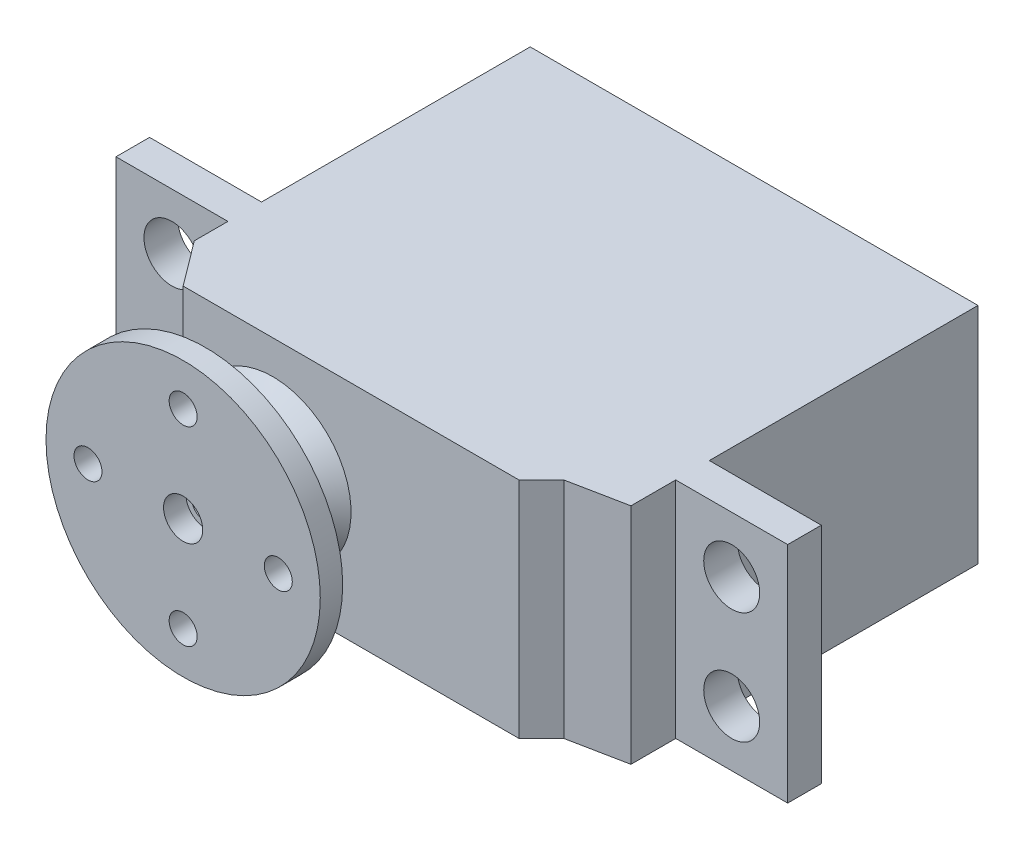
ISO-10303-21;
HEADER;
FILE_DESCRIPTION(('STEP AP214'),'2;1');
FILE_NAME('part.step','',(''),(''),'','','');
FILE_SCHEMA(('AUTOMOTIVE_DESIGN { 1 0 10303 214 1 1 1 1 }'));
ENDSEC;
DATA;
#1=APPLICATION_CONTEXT('core data for automotive mechanical design processes');
#2=APPLICATION_PROTOCOL_DEFINITION('international standard','automotive_design',2000,#1);
#3=PRODUCT_CONTEXT('',#1,'mechanical');
#4=PRODUCT('Part','Part','',(#3));
#5=PRODUCT_RELATED_PRODUCT_CATEGORY('part','',(#4));
#6=PRODUCT_DEFINITION_FORMATION('','',#4);
#7=PRODUCT_DEFINITION_CONTEXT('part definition',#1,'design');
#8=PRODUCT_DEFINITION('design','',#6,#7);
#9=PRODUCT_DEFINITION_SHAPE('','',#8);
#10=(LENGTH_UNIT() NAMED_UNIT(*) SI_UNIT(.MILLI.,.METRE.));
#11=(NAMED_UNIT(*) PLANE_ANGLE_UNIT() SI_UNIT($,.RADIAN.));
#12=(NAMED_UNIT(*) SI_UNIT($,.STERADIAN.) SOLID_ANGLE_UNIT());
#13=UNCERTAINTY_MEASURE_WITH_UNIT(LENGTH_MEASURE(1.E-05),#10,'distance_accuracy_value','');
#14=(GEOMETRIC_REPRESENTATION_CONTEXT(3) GLOBAL_UNCERTAINTY_ASSIGNED_CONTEXT((#13)) GLOBAL_UNIT_ASSIGNED_CONTEXT((#10,
#11,#12)) REPRESENTATION_CONTEXT('',''));
#15=CARTESIAN_POINT('',(0.,0.,0.));
#16=DIRECTION('',(0.,0.,1.));
#17=DIRECTION('',(1.,0.,0.));
#18=AXIS2_PLACEMENT_3D('',#15,#16,#17);
#19=CARTESIAN_POINT('',(20.,-10.,37.));
#20=DIRECTION('',(-1.,0.,0.));
#21=DIRECTION('',(0.,0.,1.));
#22=AXIS2_PLACEMENT_3D('',#19,#20,#21);
#23=PLANE('',#22);
#24=DIRECTION('',(0.,1.,0.));
#25=VECTOR('',#24,1.);
#26=CARTESIAN_POINT('',(20.,10.,27.));
#27=LINE('',#26,#25);
#28=CARTESIAN_POINT('',(20.,-10.,27.));
#29=VERTEX_POINT('',#28);
#30=CARTESIAN_POINT('',(20.,10.,27.));
#31=VERTEX_POINT('',#30);
#32=EDGE_CURVE('E59',#29,#31,#27,.T.);
#33=ORIENTED_EDGE('',*,*,#32,.F.);
#34=DIRECTION('',(0.,0.,-1.));
#35=VECTOR('',#34,1.);
#36=CARTESIAN_POINT('',(20.,-10.,37.));
#37=LINE('',#36,#35);
#38=CARTESIAN_POINT('',(20.,-10.,3.));
#39=VERTEX_POINT('',#38);
#40=EDGE_CURVE('E290',#29,#39,#37,.T.);
#41=ORIENTED_EDGE('',*,*,#40,.T.);
#42=DIRECTION('',(0.,1.,0.));
#43=VECTOR('',#42,1.);
#44=CARTESIAN_POINT('',(20.,10.,3.));
#45=LINE('',#44,#43);
#46=CARTESIAN_POINT('',(20.,10.,3.));
#47=VERTEX_POINT('',#46);
#48=EDGE_CURVE('E303',#39,#47,#45,.T.);
#49=ORIENTED_EDGE('',*,*,#48,.T.);
#50=DIRECTION('',(0.,0.,-1.));
#51=VECTOR('',#50,1.);
#52=CARTESIAN_POINT('',(20.,10.,37.));
#53=LINE('',#52,#51);
#54=EDGE_CURVE('E300',#31,#47,#53,.T.);
#55=ORIENTED_EDGE('',*,*,#54,.F.);
#56=EDGE_LOOP('',(#33,#41,#49,#55));
#57=FACE_BOUND('',#56,.T.);
#58=ADVANCED_FACE('F36',(#57),#23,.F.);
#59=CARTESIAN_POINT('',(-20.,-10.,37.));
#60=DIRECTION('',(1.,0.,0.));
#61=DIRECTION('',(0.,0.,-1.));
#62=AXIS2_PLACEMENT_3D('',#59,#60,#61);
#63=PLANE('',#62);
#64=DIRECTION('',(0.,-1.,0.));
#65=VECTOR('',#64,1.);
#66=CARTESIAN_POINT('',(-20.,10.,27.));
#67=LINE('',#66,#65);
#68=CARTESIAN_POINT('',(-20.,10.,27.));
#69=VERTEX_POINT('',#68);
#70=CARTESIAN_POINT('',(-20.,-10.,27.));
#71=VERTEX_POINT('',#70);
#72=EDGE_CURVE('E226',#69,#71,#67,.T.);
#73=ORIENTED_EDGE('',*,*,#72,.F.);
#74=DIRECTION('',(0.,0.,-1.));
#75=VECTOR('',#74,1.);
#76=CARTESIAN_POINT('',(-20.,10.,37.));
#77=LINE('',#76,#75);
#78=CARTESIAN_POINT('',(-20.,10.,3.));
#79=VERTEX_POINT('',#78);
#80=EDGE_CURVE('E297',#69,#79,#77,.T.);
#81=ORIENTED_EDGE('',*,*,#80,.T.);
#82=DIRECTION('',(0.,-1.,0.));
#83=VECTOR('',#82,1.);
#84=CARTESIAN_POINT('',(-20.,-10.,3.));
#85=LINE('',#84,#83);
#86=CARTESIAN_POINT('',(-20.,-10.,3.));
#87=VERTEX_POINT('',#86);
#88=EDGE_CURVE('E319',#79,#87,#85,.T.);
#89=ORIENTED_EDGE('',*,*,#88,.T.);
#90=DIRECTION('',(0.,0.,-1.));
#91=VECTOR('',#90,1.);
#92=CARTESIAN_POINT('',(-20.,-10.,37.));
#93=LINE('',#92,#91);
#94=EDGE_CURVE('E293',#71,#87,#93,.T.);
#95=ORIENTED_EDGE('',*,*,#94,.F.);
#96=EDGE_LOOP('',(#73,#81,#89,#95));
#97=FACE_BOUND('',#96,.T.);
#98=ADVANCED_FACE('F381',(#97),#63,.F.);
#99=CARTESIAN_POINT('',(20.,-10.,34.));
#100=VERTEX_POINT('',#99);
#101=CARTESIAN_POINT('',(20.,-10.,30.));
#102=VERTEX_POINT('',#101);
#103=EDGE_CURVE('E291',#100,#102,#37,.T.);
#104=ORIENTED_EDGE('',*,*,#103,.T.);
#105=DIRECTION('',(0.,1.,0.));
#106=VECTOR('',#105,1.);
#107=CARTESIAN_POINT('',(20.,10.,30.));
#108=LINE('',#107,#106);
#109=CARTESIAN_POINT('',(20.,10.,30.));
#110=VERTEX_POINT('',#109);
#111=EDGE_CURVE('E51',#102,#110,#108,.T.);
#112=ORIENTED_EDGE('',*,*,#111,.T.);
#113=CARTESIAN_POINT('',(20.,10.,34.));
#114=VERTEX_POINT('',#113);
#115=EDGE_CURVE('E301',#114,#110,#53,.T.);
#116=ORIENTED_EDGE('',*,*,#115,.F.);
#117=DIRECTION('',(0.,-1.,0.));
#118=VECTOR('',#117,1.);
#119=CARTESIAN_POINT('',(20.,10.,34.));
#120=LINE('',#119,#118);
#121=EDGE_CURVE('E278',#114,#100,#120,.T.);
#122=ORIENTED_EDGE('',*,*,#121,.T.);
#123=EDGE_LOOP('',(#104,#112,#116,#122));
#124=FACE_BOUND('',#123,.T.);
#125=ADVANCED_FACE('F409',(#124),#23,.F.);
#126=CARTESIAN_POINT('',(-20.,10.,37.));
#127=DIRECTION('',(0.,-1.,0.));
#128=DIRECTION('',(0.,0.,-1.));
#129=AXIS2_PLACEMENT_3D('',#126,#127,#128);
#130=PLANE('',#129);
#131=ORIENTED_EDGE('',*,*,#115,.T.);
#132=DIRECTION('',(1.,0.,0.));
#133=VECTOR('',#132,1.);
#134=CARTESIAN_POINT('',(20.,10.,30.));
#135=LINE('',#134,#133);
#136=CARTESIAN_POINT('',(30.,10.,30.));
#137=VERTEX_POINT('',#136);
#138=EDGE_CURVE('E196',#110,#137,#135,.T.);
#139=ORIENTED_EDGE('',*,*,#138,.T.);
#140=DIRECTION('',(0.,0.,1.));
#141=VECTOR('',#140,1.);
#142=CARTESIAN_POINT('',(30.,10.,27.));
#143=LINE('',#142,#141);
#144=CARTESIAN_POINT('',(30.,10.,27.));
#145=VERTEX_POINT('',#144);
#146=EDGE_CURVE('E219',#145,#137,#143,.T.);
#147=ORIENTED_EDGE('',*,*,#146,.F.);
#148=DIRECTION('',(1.,0.,0.));
#149=VECTOR('',#148,1.);
#150=CARTESIAN_POINT('',(20.,10.,27.));
#151=LINE('',#150,#149);
#152=EDGE_CURVE('E199',#31,#145,#151,.T.);
#153=ORIENTED_EDGE('',*,*,#152,.F.);
#154=ORIENTED_EDGE('',*,*,#54,.T.);
#155=DIRECTION('',(-1.,0.,0.));
#156=VECTOR('',#155,1.);
#157=CARTESIAN_POINT('',(-20.,10.,3.));
#158=LINE('',#157,#156);
#159=EDGE_CURVE('E316',#47,#79,#158,.T.);
#160=ORIENTED_EDGE('',*,*,#159,.T.);
#161=ORIENTED_EDGE('',*,*,#80,.F.);
#162=DIRECTION('',(1.,0.,0.));
#163=VECTOR('',#162,1.);
#164=CARTESIAN_POINT('',(-20.,10.,27.));
#165=LINE('',#164,#163);
#166=CARTESIAN_POINT('',(-30.,10.,27.));
#167=VERTEX_POINT('',#166);
#168=EDGE_CURVE('E223',#167,#69,#165,.T.);
#169=ORIENTED_EDGE('',*,*,#168,.F.);
#170=DIRECTION('',(0.,0.,1.));
#171=VECTOR('',#170,1.);
#172=CARTESIAN_POINT('',(-30.,10.,27.));
#173=LINE('',#172,#171);
#174=CARTESIAN_POINT('',(-30.,10.,30.));
#175=VERTEX_POINT('',#174);
#176=EDGE_CURVE('E234',#167,#175,#173,.T.);
#177=ORIENTED_EDGE('',*,*,#176,.T.);
#178=DIRECTION('',(1.,0.,0.));
#179=VECTOR('',#178,1.);
#180=CARTESIAN_POINT('',(-20.,10.,30.));
#181=LINE('',#180,#179);
#182=CARTESIAN_POINT('',(-20.,10.,30.));
#183=VERTEX_POINT('',#182);
#184=EDGE_CURVE('E222',#175,#183,#181,.T.);
#185=ORIENTED_EDGE('',*,*,#184,.T.);
#186=CARTESIAN_POINT('',(-20.,10.,33.));
#187=VERTEX_POINT('',#186);
#188=EDGE_CURVE('E298',#187,#183,#77,.T.);
#189=ORIENTED_EDGE('',*,*,#188,.F.);
#190=DIRECTION('',(0.6,0.,0.8));
#191=VECTOR('',#190,1.);
#192=CARTESIAN_POINT('',(-17.,10.,37.));
#193=LINE('',#192,#191);
#194=CARTESIAN_POINT('',(-17.,10.,37.));
#195=VERTEX_POINT('',#194);
#196=EDGE_CURVE('E255',#187,#195,#193,.T.);
#197=ORIENTED_EDGE('',*,*,#196,.T.);
#198=DIRECTION('',(-1.,0.,0.));
#199=VECTOR('',#198,1.);
#200=CARTESIAN_POINT('',(-20.,10.,37.));
#201=LINE('',#200,#199);
#202=CARTESIAN_POINT('',(13.,10.,37.));
#203=VERTEX_POINT('',#202);
#204=EDGE_CURVE('E281',#203,#195,#201,.T.);
#205=ORIENTED_EDGE('',*,*,#204,.F.);
#206=DIRECTION('',(0.707106781186547,0.,-0.707106781186548));
#207=VECTOR('',#206,1.);
#208=CARTESIAN_POINT('',(15.,10.,35.));
#209=LINE('',#208,#207);
#210=CARTESIAN_POINT('',(15.,10.,35.));
#211=VERTEX_POINT('',#210);
#212=EDGE_CURVE('E267',#203,#211,#209,.T.);
#213=ORIENTED_EDGE('',*,*,#212,.T.);
#214=DIRECTION('',(0.98058067569092,0.,-0.196116135138184));
#215=VECTOR('',#214,1.);
#216=CARTESIAN_POINT('',(20.,10.,34.));
#217=LINE('',#216,#215);
#218=EDGE_CURVE('E270',#211,#114,#217,.T.);
#219=ORIENTED_EDGE('',*,*,#218,.T.);
#220=EDGE_LOOP('',(#131,#139,#147,#153,#154,#160,#161,#169,#177,#185,#189,#197,#205,#213,#219));
#221=FACE_BOUND('',#220,.T.);
#222=ADVANCED_FACE('F350',(#221),#130,.F.);
#223=ORIENTED_EDGE('',*,*,#188,.T.);
#224=DIRECTION('',(0.,-1.,0.));
#225=VECTOR('',#224,1.);
#226=CARTESIAN_POINT('',(-20.,10.,30.));
#227=LINE('',#226,#225);
#228=CARTESIAN_POINT('',(-20.,-10.,30.));
#229=VERTEX_POINT('',#228);
#230=EDGE_CURVE('E238',#183,#229,#227,.T.);
#231=ORIENTED_EDGE('',*,*,#230,.T.);
#232=CARTESIAN_POINT('',(-20.,-10.,33.));
#233=VERTEX_POINT('',#232);
#234=EDGE_CURVE('E294',#233,#229,#93,.T.);
#235=ORIENTED_EDGE('',*,*,#234,.F.);
#236=DIRECTION('',(0.,-1.,0.));
#237=VECTOR('',#236,1.);
#238=CARTESIAN_POINT('',(-20.,10.,33.));
#239=LINE('',#238,#237);
#240=EDGE_CURVE('E258',#187,#233,#239,.T.);
#241=ORIENTED_EDGE('',*,*,#240,.F.);
#242=EDGE_LOOP('',(#223,#231,#235,#241));
#243=FACE_BOUND('',#242,.T.);
#244=ADVANCED_FACE('F358',(#243),#63,.F.);
#245=CARTESIAN_POINT('',(-20.,-10.,37.));
#246=DIRECTION('',(0.,1.,0.));
#247=DIRECTION('',(0.,0.,1.));
#248=AXIS2_PLACEMENT_3D('',#245,#246,#247);
#249=PLANE('',#248);
#250=ORIENTED_EDGE('',*,*,#234,.T.);
#251=DIRECTION('',(-1.,0.,0.));
#252=VECTOR('',#251,1.);
#253=CARTESIAN_POINT('',(-20.,-10.,30.));
#254=LINE('',#253,#252);
#255=CARTESIAN_POINT('',(-30.,-10.,30.));
#256=VERTEX_POINT('',#255);
#257=EDGE_CURVE('E240',#229,#256,#254,.T.);
#258=ORIENTED_EDGE('',*,*,#257,.T.);
#259=DIRECTION('',(0.,0.,1.));
#260=VECTOR('',#259,1.);
#261=CARTESIAN_POINT('',(-30.,-10.,27.));
#262=LINE('',#261,#260);
#263=CARTESIAN_POINT('',(-30.,-10.,27.));
#264=VERTEX_POINT('',#263);
#265=EDGE_CURVE('E245',#264,#256,#262,.T.);
#266=ORIENTED_EDGE('',*,*,#265,.F.);
#267=DIRECTION('',(-1.,0.,0.));
#268=VECTOR('',#267,1.);
#269=CARTESIAN_POINT('',(-20.,-10.,27.));
#270=LINE('',#269,#268);
#271=EDGE_CURVE('E230',#71,#264,#270,.T.);
#272=ORIENTED_EDGE('',*,*,#271,.F.);
#273=ORIENTED_EDGE('',*,*,#94,.T.);
#274=DIRECTION('',(1.,0.,0.));
#275=VECTOR('',#274,1.);
#276=CARTESIAN_POINT('',(20.,-10.,3.));
#277=LINE('',#276,#275);
#278=EDGE_CURVE('E322',#87,#39,#277,.T.);
#279=ORIENTED_EDGE('',*,*,#278,.T.);
#280=ORIENTED_EDGE('',*,*,#40,.F.);
#281=DIRECTION('',(-1.,0.,0.));
#282=VECTOR('',#281,1.);
#283=CARTESIAN_POINT('',(20.,-10.,27.));
#284=LINE('',#283,#282);
#285=CARTESIAN_POINT('',(30.,-10.,27.));
#286=VERTEX_POINT('',#285);
#287=EDGE_CURVE('E204',#286,#29,#284,.T.);
#288=ORIENTED_EDGE('',*,*,#287,.F.);
#289=DIRECTION('',(0.,0.,1.));
#290=VECTOR('',#289,1.);
#291=CARTESIAN_POINT('',(30.,-10.,27.));
#292=LINE('',#291,#290);
#293=CARTESIAN_POINT('',(30.,-10.,30.));
#294=VERTEX_POINT('',#293);
#295=EDGE_CURVE('E208',#286,#294,#292,.T.);
#296=ORIENTED_EDGE('',*,*,#295,.T.);
#297=DIRECTION('',(-1.,0.,0.));
#298=VECTOR('',#297,1.);
#299=CARTESIAN_POINT('',(20.,-10.,30.));
#300=LINE('',#299,#298);
#301=EDGE_CURVE('E213',#294,#102,#300,.T.);
#302=ORIENTED_EDGE('',*,*,#301,.T.);
#303=ORIENTED_EDGE('',*,*,#103,.F.);
#304=DIRECTION('',(0.98058067569092,0.,-0.196116135138184));
#305=VECTOR('',#304,1.);
#306=CARTESIAN_POINT('',(20.,-10.,34.));
#307=LINE('',#306,#305);
#308=CARTESIAN_POINT('',(15.,-10.,35.));
#309=VERTEX_POINT('',#308);
#310=EDGE_CURVE('E271',#309,#100,#307,.T.);
#311=ORIENTED_EDGE('',*,*,#310,.F.);
#312=DIRECTION('',(0.707106781186547,0.,-0.707106781186548));
#313=VECTOR('',#312,1.);
#314=CARTESIAN_POINT('',(15.,-10.,35.));
#315=LINE('',#314,#313);
#316=CARTESIAN_POINT('',(13.,-10.,37.));
#317=VERTEX_POINT('',#316);
#318=EDGE_CURVE('E265',#317,#309,#315,.T.);
#319=ORIENTED_EDGE('',*,*,#318,.F.);
#320=DIRECTION('',(1.,0.,0.));
#321=VECTOR('',#320,1.);
#322=CARTESIAN_POINT('',(-20.,-10.,37.));
#323=LINE('',#322,#321);
#324=CARTESIAN_POINT('',(-17.,-10.,37.));
#325=VERTEX_POINT('',#324);
#326=EDGE_CURVE('E288',#325,#317,#323,.T.);
#327=ORIENTED_EDGE('',*,*,#326,.F.);
#328=DIRECTION('',(0.6,0.,0.8));
#329=VECTOR('',#328,1.);
#330=CARTESIAN_POINT('',(-17.,-10.,37.));
#331=LINE('',#330,#329);
#332=EDGE_CURVE('E259',#233,#325,#331,.T.);
#333=ORIENTED_EDGE('',*,*,#332,.F.);
#334=EDGE_LOOP('',(#250,#258,#266,#272,#273,#279,#280,#288,#296,#302,#303,#311,#319,#327,#333));
#335=FACE_BOUND('',#334,.T.);
#336=ADVANCED_FACE('F344',(#335),#249,.F.);
#337=CARTESIAN_POINT('',(0.,0.,37.));
#338=DIRECTION('',(0.,0.,-1.));
#339=DIRECTION('',(-1.,0.,0.));
#340=AXIS2_PLACEMENT_3D('',#337,#338,#339);
#341=PLANE('',#340);
#342=CARTESIAN_POINT('',(-9.,0.,37.));
#343=DIRECTION('',(0.,0.,-1.));
#344=DIRECTION('',(-1.,0.,0.));
#345=AXIS2_PLACEMENT_3D('',#342,#343,#344);
#346=CIRCLE('',#345,7.);
#347=CARTESIAN_POINT('',(-16.,0.,37.));
#348=VERTEX_POINT('',#347);
#349=EDGE_CURVE('E44',#348,#348,#346,.F.);
#350=ORIENTED_EDGE('',*,*,#349,.F.);
#351=EDGE_LOOP('',(#350));
#352=FACE_BOUND('',#351,.T.);
#353=ORIENTED_EDGE('',*,*,#204,.T.);
#354=DIRECTION('',(0.,-1.,0.));
#355=VECTOR('',#354,1.);
#356=CARTESIAN_POINT('',(-17.,10.,37.));
#357=LINE('',#356,#355);
#358=EDGE_CURVE('E262',#195,#325,#357,.T.);
#359=ORIENTED_EDGE('',*,*,#358,.T.);
#360=ORIENTED_EDGE('',*,*,#326,.T.);
#361=DIRECTION('',(0.,-1.,0.));
#362=VECTOR('',#361,1.);
#363=CARTESIAN_POINT('',(13.,10.,37.));
#364=LINE('',#363,#362);
#365=EDGE_CURVE('E274',#203,#317,#364,.T.);
#366=ORIENTED_EDGE('',*,*,#365,.F.);
#367=EDGE_LOOP('',(#353,#359,#360,#366));
#368=FACE_BOUND('',#367,.T.);
#369=ADVANCED_FACE('F340',(#352,#368),#341,.F.);
#370=CARTESIAN_POINT('',(0.,0.,0.));
#371=DIRECTION('',(0.,0.,-1.));
#372=DIRECTION('',(-1.,0.,0.));
#373=AXIS2_PLACEMENT_3D('',#370,#371,#372);
#374=PLANE('',#373);
#375=DIRECTION('',(1.,0.,0.));
#376=VECTOR('',#375,1.);
#377=CARTESIAN_POINT('',(20.,6.99999999999999,0.));
#378=LINE('',#377,#376);
#379=CARTESIAN_POINT('',(-17.,6.99999999999999,0.));
#380=VERTEX_POINT('',#379);
#381=CARTESIAN_POINT('',(17.,6.99999999999999,0.));
#382=VERTEX_POINT('',#381);
#383=EDGE_CURVE('E310',#380,#382,#378,.T.);
#384=ORIENTED_EDGE('',*,*,#383,.T.);
#385=DIRECTION('',(0.,-1.,0.));
#386=VECTOR('',#385,1.);
#387=CARTESIAN_POINT('',(17.,-10.,0.));
#388=LINE('',#387,#386);
#389=CARTESIAN_POINT('',(17.,-6.99999999999999,0.));
#390=VERTEX_POINT('',#389);
#391=EDGE_CURVE('E313',#382,#390,#388,.T.);
#392=ORIENTED_EDGE('',*,*,#391,.T.);
#393=DIRECTION('',(-1.,0.,0.));
#394=VECTOR('',#393,1.);
#395=CARTESIAN_POINT('',(-20.,-6.99999999999999,0.));
#396=LINE('',#395,#394);
#397=CARTESIAN_POINT('',(-17.,-6.99999999999999,0.));
#398=VERTEX_POINT('',#397);
#399=EDGE_CURVE('E306',#390,#398,#396,.T.);
#400=ORIENTED_EDGE('',*,*,#399,.T.);
#401=DIRECTION('',(0.,1.,0.));
#402=VECTOR('',#401,1.);
#403=CARTESIAN_POINT('',(-17.,10.,0.));
#404=LINE('',#403,#402);
#405=EDGE_CURVE('E308',#398,#380,#404,.T.);
#406=ORIENTED_EDGE('',*,*,#405,.T.);
#407=EDGE_LOOP('',(#384,#392,#400,#406));
#408=FACE_BOUND('',#407,.T.);
#409=ADVANCED_FACE('F343',(#408),#374,.T.);
#410=CARTESIAN_POINT('',(20.,10.,34.));
#411=DIRECTION('',(-0.196116135138184,0.,-0.98058067569092));
#412=DIRECTION('',(-0.98058067569092,0.,0.196116135138184));
#413=AXIS2_PLACEMENT_3D('',#410,#411,#412);
#414=PLANE('',#413);
#415=ORIENTED_EDGE('',*,*,#310,.T.);
#416=ORIENTED_EDGE('',*,*,#121,.F.);
#417=ORIENTED_EDGE('',*,*,#218,.F.);
#418=DIRECTION('',(0.,-1.,0.));
#419=VECTOR('',#418,1.);
#420=CARTESIAN_POINT('',(15.,10.,35.));
#421=LINE('',#420,#419);
#422=EDGE_CURVE('E282',#211,#309,#421,.T.);
#423=ORIENTED_EDGE('',*,*,#422,.T.);
#424=EDGE_LOOP('',(#415,#416,#417,#423));
#425=FACE_BOUND('',#424,.T.);
#426=ADVANCED_FACE('F413',(#425),#414,.F.);
#427=CARTESIAN_POINT('',(15.,10.,35.));
#428=DIRECTION('',(-0.707106781186548,0.,-0.707106781186547));
#429=DIRECTION('',(-0.707106781186547,0.,0.707106781186548));
#430=AXIS2_PLACEMENT_3D('',#427,#428,#429);
#431=PLANE('',#430);
#432=ORIENTED_EDGE('',*,*,#318,.T.);
#433=ORIENTED_EDGE('',*,*,#422,.F.);
#434=ORIENTED_EDGE('',*,*,#212,.F.);
#435=ORIENTED_EDGE('',*,*,#365,.T.);
#436=EDGE_LOOP('',(#432,#433,#434,#435));
#437=FACE_BOUND('',#436,.T.);
#438=ADVANCED_FACE('F415',(#437),#431,.F.);
#439=CARTESIAN_POINT('',(-17.,10.,37.));
#440=DIRECTION('',(0.8,0.,-0.6));
#441=DIRECTION('',(-0.6,0.,-0.8));
#442=AXIS2_PLACEMENT_3D('',#439,#440,#441);
#443=PLANE('',#442);
#444=ORIENTED_EDGE('',*,*,#332,.T.);
#445=ORIENTED_EDGE('',*,*,#358,.F.);
#446=ORIENTED_EDGE('',*,*,#196,.F.);
#447=ORIENTED_EDGE('',*,*,#240,.T.);
#448=EDGE_LOOP('',(#444,#445,#446,#447));
#449=FACE_BOUND('',#448,.T.);
#450=ADVANCED_FACE('F354',(#449),#443,.F.);
#451=CARTESIAN_POINT('',(-20.,-10.,3.));
#452=DIRECTION('',(-0.707106781186547,0.,-0.707106781186548));
#453=DIRECTION('',(0.,1.,0.));
#454=AXIS2_PLACEMENT_3D('',#451,#452,#453);
#455=PLANE('',#454);
#456=DIRECTION('',(0.577350269189626,-0.577350269189626,-0.577350269189625));
#457=VECTOR('',#456,1.);
#458=CARTESIAN_POINT('',(-13.3333333333333,3.33333333333332,-3.66666666666666));
#459=LINE('',#458,#457);
#460=EDGE_CURVE('E331',#380,#79,#459,.F.);
#461=ORIENTED_EDGE('',*,*,#460,.F.);
#462=ORIENTED_EDGE('',*,*,#405,.F.);
#463=DIRECTION('',(0.577350269189626,0.577350269189626,-0.577350269189625));
#464=VECTOR('',#463,1.);
#465=CARTESIAN_POINT('',(-20.,-10.,3.));
#466=LINE('',#465,#464);
#467=EDGE_CURVE('E261',#87,#398,#466,.T.);
#468=ORIENTED_EDGE('',*,*,#467,.F.);
#469=ORIENTED_EDGE('',*,*,#88,.F.);
#470=EDGE_LOOP('',(#461,#462,#468,#469));
#471=FACE_BOUND('',#470,.T.);
#472=ADVANCED_FACE('F385',(#471),#455,.T.);
#473=CARTESIAN_POINT('',(-20.,-10.,3.));
#474=DIRECTION('',(0.,-0.707106781186547,-0.707106781186548));
#475=DIRECTION('',(-1.,0.,0.));
#476=AXIS2_PLACEMENT_3D('',#473,#474,#475);
#477=PLANE('',#476);
#478=ORIENTED_EDGE('',*,*,#467,.T.);
#479=ORIENTED_EDGE('',*,*,#399,.F.);
#480=DIRECTION('',(0.577350269189626,-0.577350269189626,0.577350269189625));
#481=VECTOR('',#480,1.);
#482=CARTESIAN_POINT('',(6.66666666666665,3.33333333333335,-10.3333333333333));
#483=LINE('',#482,#481);
#484=EDGE_CURVE('E328',#39,#390,#483,.F.);
#485=ORIENTED_EDGE('',*,*,#484,.F.);
#486=ORIENTED_EDGE('',*,*,#278,.F.);
#487=EDGE_LOOP('',(#478,#479,#485,#486));
#488=FACE_BOUND('',#487,.T.);
#489=ADVANCED_FACE('F388',(#488),#477,.T.);
#490=CARTESIAN_POINT('',(-20.,10.,3.));
#491=DIRECTION('',(0.,0.707106781186547,-0.707106781186548));
#492=DIRECTION('',(1.,0.,0.));
#493=AXIS2_PLACEMENT_3D('',#490,#491,#492);
#494=PLANE('',#493);
#495=ORIENTED_EDGE('',*,*,#460,.T.);
#496=ORIENTED_EDGE('',*,*,#159,.F.);
#497=DIRECTION('',(-0.577350269189626,-0.577350269189626,-0.577350269189625));
#498=VECTOR('',#497,1.);
#499=CARTESIAN_POINT('',(6.66666666666665,-3.33333333333335,-10.3333333333333));
#500=LINE('',#499,#498);
#501=EDGE_CURVE('E252',#382,#47,#500,.F.);
#502=ORIENTED_EDGE('',*,*,#501,.F.);
#503=ORIENTED_EDGE('',*,*,#383,.F.);
#504=EDGE_LOOP('',(#495,#496,#502,#503));
#505=FACE_BOUND('',#504,.T.);
#506=ADVANCED_FACE('F448',(#505),#494,.T.);
#507=CARTESIAN_POINT('',(20.,-10.,3.));
#508=DIRECTION('',(0.707106781186547,0.,-0.707106781186548));
#509=DIRECTION('',(0.,-1.,0.));
#510=AXIS2_PLACEMENT_3D('',#507,#508,#509);
#511=PLANE('',#510);
#512=ORIENTED_EDGE('',*,*,#484,.T.);
#513=ORIENTED_EDGE('',*,*,#391,.F.);
#514=ORIENTED_EDGE('',*,*,#501,.T.);
#515=ORIENTED_EDGE('',*,*,#48,.F.);
#516=EDGE_LOOP('',(#512,#513,#514,#515));
#517=FACE_BOUND('',#516,.T.);
#518=ADVANCED_FACE('F392',(#517),#511,.T.);
#519=CARTESIAN_POINT('',(-9.,0.,39.));
#520=DIRECTION('',(0.,0.,1.));
#521=DIRECTION('',(1.,0.,0.));
#522=AXIS2_PLACEMENT_3D('',#519,#520,#521);
#523=PLANE('',#522);
#524=CARTESIAN_POINT('',(-9.,0.,39.));
#525=DIRECTION('',(0.,0.,1.));
#526=DIRECTION('',(1.,0.,0.));
#527=AXIS2_PLACEMENT_3D('',#524,#525,#526);
#528=CIRCLE('',#527,3.);
#529=CARTESIAN_POINT('',(-6.,0.,39.));
#530=VERTEX_POINT('',#529);
#531=EDGE_CURVE('E248',#530,#530,#528,.T.);
#532=ORIENTED_EDGE('',*,*,#531,.F.);
#533=EDGE_LOOP('',(#532));
#534=FACE_BOUND('',#533,.T.);
#535=CARTESIAN_POINT('',(-9.,0.,39.));
#536=DIRECTION('',(0.,0.,1.));
#537=DIRECTION('',(1.,0.,0.));
#538=AXIS2_PLACEMENT_3D('',#535,#536,#537);
#539=CIRCLE('',#538,5.);
#540=CARTESIAN_POINT('',(-4.,0.,39.));
#541=VERTEX_POINT('',#540);
#542=EDGE_CURVE('E11',#541,#541,#539,.T.);
#543=ORIENTED_EDGE('',*,*,#542,.T.);
#544=EDGE_LOOP('',(#543));
#545=FACE_BOUND('',#544,.T.);
#546=ADVANCED_FACE('F455',(#534,#545),#523,.T.);
#547=CARTESIAN_POINT('',(-9.,0.,39.));
#548=DIRECTION('',(0.,0.,-1.));
#549=DIRECTION('',(-1.,0.,0.));
#550=AXIS2_PLACEMENT_3D('',#547,#548,#549);
#551=CONICAL_SURFACE('',#550,5.,0.785398163397447);
#552=ORIENTED_EDGE('',*,*,#349,.T.);
#553=EDGE_LOOP('',(#552));
#554=FACE_BOUND('',#553,.T.);
#555=ORIENTED_EDGE('',*,*,#542,.F.);
#556=EDGE_LOOP('',(#555));
#557=FACE_BOUND('',#556,.T.);
#558=ADVANCED_FACE('F38',(#554,#557),#551,.T.);
#559=CARTESIAN_POINT('',(-9.,0.,43.));
#560=DIRECTION('',(0.,0.,-1.));
#561=DIRECTION('',(-1.,0.,0.));
#562=AXIS2_PLACEMENT_3D('',#559,#560,#561);
#563=CYLINDRICAL_SURFACE('',#562,3.);
#564=CARTESIAN_POINT('',(-9.,0.,43.));
#565=DIRECTION('',(0.,0.,1.));
#566=DIRECTION('',(1.,0.,0.));
#567=AXIS2_PLACEMENT_3D('',#564,#565,#566);
#568=CIRCLE('',#567,3.);
#569=CARTESIAN_POINT('',(-6.,0.,43.));
#570=VERTEX_POINT('',#569);
#571=EDGE_CURVE('E249',#570,#570,#568,.T.);
#572=ORIENTED_EDGE('',*,*,#571,.F.);
#573=EDGE_LOOP('',(#572));
#574=FACE_BOUND('',#573,.T.);
#575=ORIENTED_EDGE('',*,*,#531,.T.);
#576=EDGE_LOOP('',(#575));
#577=FACE_BOUND('',#576,.T.);
#578=ADVANCED_FACE('F499',(#574,#577),#563,.T.);
#579=CARTESIAN_POINT('',(-30.,10.,27.));
#580=DIRECTION('',(1.,0.,0.));
#581=DIRECTION('',(0.,0.,-1.));
#582=AXIS2_PLACEMENT_3D('',#579,#580,#581);
#583=PLANE('',#582);
#584=DIRECTION('',(0.,1.,0.));
#585=VECTOR('',#584,1.);
#586=CARTESIAN_POINT('',(-30.,10.,30.));
#587=LINE('',#586,#585);
#588=EDGE_CURVE('E227',#256,#175,#587,.T.);
#589=ORIENTED_EDGE('',*,*,#588,.T.);
#590=ORIENTED_EDGE('',*,*,#176,.F.);
#591=DIRECTION('',(0.,1.,0.));
#592=VECTOR('',#591,1.);
#593=CARTESIAN_POINT('',(-30.,10.,27.));
#594=LINE('',#593,#592);
#595=EDGE_CURVE('E232',#264,#167,#594,.T.);
#596=ORIENTED_EDGE('',*,*,#595,.F.);
#597=ORIENTED_EDGE('',*,*,#265,.T.);
#598=EDGE_LOOP('',(#589,#590,#596,#597));
#599=FACE_BOUND('',#598,.T.);
#600=ADVANCED_FACE('F369',(#599),#583,.F.);
#601=CARTESIAN_POINT('',(0.,0.,27.));
#602=DIRECTION('',(0.,0.,1.));
#603=DIRECTION('',(1.,0.,0.));
#604=AXIS2_PLACEMENT_3D('',#601,#602,#603);
#605=PLANE('',#604);
#606=CARTESIAN_POINT('',(-25.,-5.,27.));
#607=DIRECTION('',(0.,0.,1.));
#608=DIRECTION('',(1.,0.,0.));
#609=AXIS2_PLACEMENT_3D('',#606,#607,#608);
#610=CIRCLE('',#609,2.5);
#611=CARTESIAN_POINT('',(-22.5,-5.,27.));
#612=VERTEX_POINT('',#611);
#613=EDGE_CURVE('E187',#612,#612,#610,.T.);
#614=ORIENTED_EDGE('',*,*,#613,.T.);
#615=EDGE_LOOP('',(#614));
#616=FACE_BOUND('',#615,.T.);
#617=CARTESIAN_POINT('',(-25.,5.,27.));
#618=DIRECTION('',(0.,0.,1.));
#619=DIRECTION('',(1.,0.,0.));
#620=AXIS2_PLACEMENT_3D('',#617,#618,#619);
#621=CIRCLE('',#620,2.5);
#622=CARTESIAN_POINT('',(-22.5,5.,27.));
#623=VERTEX_POINT('',#622);
#624=EDGE_CURVE('E193',#623,#623,#621,.T.);
#625=ORIENTED_EDGE('',*,*,#624,.T.);
#626=EDGE_LOOP('',(#625));
#627=FACE_BOUND('',#626,.T.);
#628=ORIENTED_EDGE('',*,*,#168,.T.);
#629=ORIENTED_EDGE('',*,*,#72,.T.);
#630=ORIENTED_EDGE('',*,*,#271,.T.);
#631=ORIENTED_EDGE('',*,*,#595,.T.);
#632=EDGE_LOOP('',(#628,#629,#630,#631));
#633=FACE_BOUND('',#632,.T.);
#634=ADVANCED_FACE('F374',(#616,#627,#633),#605,.F.);
#635=CARTESIAN_POINT('',(0.,0.,30.));
#636=DIRECTION('',(0.,0.,1.));
#637=DIRECTION('',(1.,0.,0.));
#638=AXIS2_PLACEMENT_3D('',#635,#636,#637);
#639=PLANE('',#638);
#640=CARTESIAN_POINT('',(-25.,-5.,30.));
#641=DIRECTION('',(0.,0.,1.));
#642=DIRECTION('',(1.,0.,0.));
#643=AXIS2_PLACEMENT_3D('',#640,#641,#642);
#644=CIRCLE('',#643,2.5);
#645=CARTESIAN_POINT('',(-22.5,-5.,30.));
#646=VERTEX_POINT('',#645);
#647=EDGE_CURVE('E184',#646,#646,#644,.T.);
#648=ORIENTED_EDGE('',*,*,#647,.F.);
#649=EDGE_LOOP('',(#648));
#650=FACE_BOUND('',#649,.T.);
#651=CARTESIAN_POINT('',(-25.,5.,30.));
#652=DIRECTION('',(0.,0.,1.));
#653=DIRECTION('',(1.,0.,0.));
#654=AXIS2_PLACEMENT_3D('',#651,#652,#653);
#655=CIRCLE('',#654,2.5);
#656=CARTESIAN_POINT('',(-22.5,5.,30.));
#657=VERTEX_POINT('',#656);
#658=EDGE_CURVE('E190',#657,#657,#655,.T.);
#659=ORIENTED_EDGE('',*,*,#658,.F.);
#660=EDGE_LOOP('',(#659));
#661=FACE_BOUND('',#660,.T.);
#662=ORIENTED_EDGE('',*,*,#184,.F.);
#663=ORIENTED_EDGE('',*,*,#588,.F.);
#664=ORIENTED_EDGE('',*,*,#257,.F.);
#665=ORIENTED_EDGE('',*,*,#230,.F.);
#666=EDGE_LOOP('',(#662,#663,#664,#665));
#667=FACE_BOUND('',#666,.T.);
#668=ADVANCED_FACE('F366',(#650,#661,#667),#639,.T.);
#669=CARTESIAN_POINT('',(30.,10.,27.));
#670=DIRECTION('',(-1.,0.,0.));
#671=DIRECTION('',(0.,0.,1.));
#672=AXIS2_PLACEMENT_3D('',#669,#670,#671);
#673=PLANE('',#672);
#674=DIRECTION('',(0.,-1.,0.));
#675=VECTOR('',#674,1.);
#676=CARTESIAN_POINT('',(30.,10.,30.));
#677=LINE('',#676,#675);
#678=EDGE_CURVE('E211',#137,#294,#677,.T.);
#679=ORIENTED_EDGE('',*,*,#678,.T.);
#680=ORIENTED_EDGE('',*,*,#295,.F.);
#681=DIRECTION('',(0.,-1.,0.));
#682=VECTOR('',#681,1.);
#683=CARTESIAN_POINT('',(30.,10.,27.));
#684=LINE('',#683,#682);
#685=EDGE_CURVE('E202',#145,#286,#684,.T.);
#686=ORIENTED_EDGE('',*,*,#685,.F.);
#687=ORIENTED_EDGE('',*,*,#146,.T.);
#688=EDGE_LOOP('',(#679,#680,#686,#687));
#689=FACE_BOUND('',#688,.T.);
#690=ADVANCED_FACE('F402',(#689),#673,.F.);
#691=CARTESIAN_POINT('',(0.,0.,27.));
#692=DIRECTION('',(0.,0.,-1.));
#693=DIRECTION('',(-1.,0.,0.));
#694=AXIS2_PLACEMENT_3D('',#691,#692,#693);
#695=PLANE('',#694);
#696=CARTESIAN_POINT('',(25.,-5.,27.));
#697=DIRECTION('',(0.,0.,-1.));
#698=DIRECTION('',(-1.,0.,0.));
#699=AXIS2_PLACEMENT_3D('',#696,#697,#698);
#700=CIRCLE('',#699,2.5);
#701=CARTESIAN_POINT('',(22.5,-5.,27.));
#702=VERTEX_POINT('',#701);
#703=EDGE_CURVE('E171',#702,#702,#700,.T.);
#704=ORIENTED_EDGE('',*,*,#703,.F.);
#705=EDGE_LOOP('',(#704));
#706=FACE_BOUND('',#705,.T.);
#707=CARTESIAN_POINT('',(25.,5.,27.));
#708=DIRECTION('',(0.,0.,-1.));
#709=DIRECTION('',(-1.,0.,0.));
#710=AXIS2_PLACEMENT_3D('',#707,#708,#709);
#711=CIRCLE('',#710,2.5);
#712=CARTESIAN_POINT('',(22.5,5.,27.));
#713=VERTEX_POINT('',#712);
#714=EDGE_CURVE('E181',#713,#713,#711,.T.);
#715=ORIENTED_EDGE('',*,*,#714,.F.);
#716=EDGE_LOOP('',(#715));
#717=FACE_BOUND('',#716,.T.);
#718=ORIENTED_EDGE('',*,*,#152,.T.);
#719=ORIENTED_EDGE('',*,*,#685,.T.);
#720=ORIENTED_EDGE('',*,*,#287,.T.);
#721=ORIENTED_EDGE('',*,*,#32,.T.);
#722=EDGE_LOOP('',(#718,#719,#720,#721));
#723=FACE_BOUND('',#722,.T.);
#724=ADVANCED_FACE('F397',(#706,#717,#723),#695,.T.);
#725=CARTESIAN_POINT('',(0.,0.,30.));
#726=DIRECTION('',(0.,0.,-1.));
#727=DIRECTION('',(-1.,0.,0.));
#728=AXIS2_PLACEMENT_3D('',#725,#726,#727);
#729=PLANE('',#728);
#730=CARTESIAN_POINT('',(25.,-5.,30.));
#731=DIRECTION('',(0.,0.,-1.));
#732=DIRECTION('',(-1.,0.,0.));
#733=AXIS2_PLACEMENT_3D('',#730,#731,#732);
#734=CIRCLE('',#733,2.5);
#735=CARTESIAN_POINT('',(22.5,-5.,30.));
#736=VERTEX_POINT('',#735);
#737=EDGE_CURVE('E167',#736,#736,#734,.T.);
#738=ORIENTED_EDGE('',*,*,#737,.T.);
#739=EDGE_LOOP('',(#738));
#740=FACE_BOUND('',#739,.T.);
#741=CARTESIAN_POINT('',(25.,5.,30.));
#742=DIRECTION('',(0.,0.,-1.));
#743=DIRECTION('',(-1.,0.,0.));
#744=AXIS2_PLACEMENT_3D('',#741,#742,#743);
#745=CIRCLE('',#744,2.5);
#746=CARTESIAN_POINT('',(22.5,5.,30.));
#747=VERTEX_POINT('',#746);
#748=EDGE_CURVE('E179',#747,#747,#745,.T.);
#749=ORIENTED_EDGE('',*,*,#748,.T.);
#750=EDGE_LOOP('',(#749));
#751=FACE_BOUND('',#750,.T.);
#752=ORIENTED_EDGE('',*,*,#138,.F.);
#753=ORIENTED_EDGE('',*,*,#111,.F.);
#754=ORIENTED_EDGE('',*,*,#301,.F.);
#755=ORIENTED_EDGE('',*,*,#678,.F.);
#756=EDGE_LOOP('',(#752,#753,#754,#755));
#757=FACE_BOUND('',#756,.T.);
#758=ADVANCED_FACE('F407',(#740,#751,#757),#729,.F.);
#759=CARTESIAN_POINT('',(-25.,5.,27.));
#760=DIRECTION('',(0.,0.,1.));
#761=DIRECTION('',(1.,0.,0.));
#762=AXIS2_PLACEMENT_3D('',#759,#760,#761);
#763=CYLINDRICAL_SURFACE('',#762,2.5);
#764=ORIENTED_EDGE('',*,*,#624,.F.);
#765=EDGE_LOOP('',(#764));
#766=FACE_BOUND('',#765,.T.);
#767=ORIENTED_EDGE('',*,*,#658,.T.);
#768=EDGE_LOOP('',(#767));
#769=FACE_BOUND('',#768,.T.);
#770=ADVANCED_FACE('F598',(#766,#769),#763,.F.);
#771=CARTESIAN_POINT('',(-25.,-5.,27.));
#772=DIRECTION('',(0.,0.,1.));
#773=DIRECTION('',(1.,0.,0.));
#774=AXIS2_PLACEMENT_3D('',#771,#772,#773);
#775=CYLINDRICAL_SURFACE('',#774,2.5);
#776=ORIENTED_EDGE('',*,*,#613,.F.);
#777=EDGE_LOOP('',(#776));
#778=FACE_BOUND('',#777,.T.);
#779=ORIENTED_EDGE('',*,*,#647,.T.);
#780=EDGE_LOOP('',(#779));
#781=FACE_BOUND('',#780,.T.);
#782=ADVANCED_FACE('F603',(#778,#781),#775,.F.);
#783=CARTESIAN_POINT('',(25.,5.,27.));
#784=DIRECTION('',(0.,0.,1.));
#785=DIRECTION('',(1.,0.,0.));
#786=AXIS2_PLACEMENT_3D('',#783,#784,#785);
#787=CYLINDRICAL_SURFACE('',#786,2.5);
#788=ORIENTED_EDGE('',*,*,#714,.T.);
#789=EDGE_LOOP('',(#788));
#790=FACE_BOUND('',#789,.T.);
#791=ORIENTED_EDGE('',*,*,#748,.F.);
#792=EDGE_LOOP('',(#791));
#793=FACE_BOUND('',#792,.T.);
#794=ADVANCED_FACE('F615',(#790,#793),#787,.F.);
#795=CARTESIAN_POINT('',(25.,-5.,27.));
#796=DIRECTION('',(0.,0.,1.));
#797=DIRECTION('',(1.,0.,0.));
#798=AXIS2_PLACEMENT_3D('',#795,#796,#797);
#799=CYLINDRICAL_SURFACE('',#798,2.5);
#800=ORIENTED_EDGE('',*,*,#703,.T.);
#801=EDGE_LOOP('',(#800));
#802=FACE_BOUND('',#801,.T.);
#803=ORIENTED_EDGE('',*,*,#737,.F.);
#804=EDGE_LOOP('',(#803));
#805=FACE_BOUND('',#804,.T.);
#806=ADVANCED_FACE('F642',(#802,#805),#799,.F.);
#807=CARTESIAN_POINT('',(-9.,0.,43.));
#808=DIRECTION('',(0.,0.,1.));
#809=DIRECTION('',(1.,0.,0.));
#810=AXIS2_PLACEMENT_3D('',#807,#808,#809);
#811=PLANE('',#810);
#812=CARTESIAN_POINT('',(-17.5,0.,43.));
#813=DIRECTION('',(0.,0.,1.));
#814=DIRECTION('',(1.,0.,0.));
#815=AXIS2_PLACEMENT_3D('',#812,#813,#814);
#816=CIRCLE('',#815,1.25);
#817=CARTESIAN_POINT('',(-16.25,0.,43.));
#818=VERTEX_POINT('',#817);
#819=EDGE_CURVE('E791',#818,#818,#816,.T.);
#820=ORIENTED_EDGE('',*,*,#819,.T.);
#821=EDGE_LOOP('',(#820));
#822=FACE_BOUND('',#821,.T.);
#823=CARTESIAN_POINT('',(-9.,-8.5,43.));
#824=DIRECTION('',(0.,0.,1.));
#825=DIRECTION('',(1.,0.,0.));
#826=AXIS2_PLACEMENT_3D('',#823,#824,#825);
#827=CIRCLE('',#826,1.25);
#828=CARTESIAN_POINT('',(-7.75,-8.5,43.));
#829=VERTEX_POINT('',#828);
#830=EDGE_CURVE('E797',#829,#829,#827,.T.);
#831=ORIENTED_EDGE('',*,*,#830,.T.);
#832=EDGE_LOOP('',(#831));
#833=FACE_BOUND('',#832,.T.);
#834=CARTESIAN_POINT('',(-0.500000000000004,0.,43.));
#835=DIRECTION('',(0.,0.,1.));
#836=DIRECTION('',(1.,0.,0.));
#837=AXIS2_PLACEMENT_3D('',#834,#835,#836);
#838=CIRCLE('',#837,1.25);
#839=CARTESIAN_POINT('',(0.749999999999997,0.,43.));
#840=VERTEX_POINT('',#839);
#841=EDGE_CURVE('E803',#840,#840,#838,.T.);
#842=ORIENTED_EDGE('',*,*,#841,.T.);
#843=EDGE_LOOP('',(#842));
#844=FACE_BOUND('',#843,.T.);
#845=CARTESIAN_POINT('',(-9.,8.5,43.));
#846=DIRECTION('',(0.,0.,1.));
#847=DIRECTION('',(1.,0.,0.));
#848=AXIS2_PLACEMENT_3D('',#845,#846,#847);
#849=CIRCLE('',#848,1.25);
#850=CARTESIAN_POINT('',(-7.75,8.5,43.));
#851=VERTEX_POINT('',#850);
#852=EDGE_CURVE('E809',#851,#851,#849,.T.);
#853=ORIENTED_EDGE('',*,*,#852,.T.);
#854=EDGE_LOOP('',(#853));
#855=FACE_BOUND('',#854,.T.);
#856=CARTESIAN_POINT('',(-9.,0.,43.));
#857=DIRECTION('',(0.,0.,1.));
#858=DIRECTION('',(1.,0.,0.));
#859=AXIS2_PLACEMENT_3D('',#856,#857,#858);
#860=CIRCLE('',#859,12.25);
#861=CARTESIAN_POINT('',(3.25,0.,43.));
#862=VERTEX_POINT('',#861);
#863=EDGE_CURVE('E815',#862,#862,#860,.T.);
#864=ORIENTED_EDGE('',*,*,#863,.F.);
#865=EDGE_LOOP('',(#864));
#866=FACE_BOUND('',#865,.T.);
#867=ORIENTED_EDGE('',*,*,#571,.T.);
#868=EDGE_LOOP('',(#867));
#869=FACE_BOUND('',#868,.T.);
#870=ADVANCED_FACE('F652',(#822,#833,#844,#855,#866,#869),#811,.F.);
#871=CARTESIAN_POINT('',(-9.,0.,45.));
#872=DIRECTION('',(0.,0.,1.));
#873=DIRECTION('',(1.,0.,0.));
#874=AXIS2_PLACEMENT_3D('',#871,#872,#873);
#875=PLANE('',#874);
#876=CARTESIAN_POINT('',(-17.5,0.,45.));
#877=DIRECTION('',(0.,0.,1.));
#878=DIRECTION('',(1.,0.,0.));
#879=AXIS2_PLACEMENT_3D('',#876,#877,#878);
#880=CIRCLE('',#879,1.25);
#881=CARTESIAN_POINT('',(-16.25,0.,45.));
#882=VERTEX_POINT('',#881);
#883=EDGE_CURVE('E794',#882,#882,#880,.T.);
#884=ORIENTED_EDGE('',*,*,#883,.F.);
#885=EDGE_LOOP('',(#884));
#886=FACE_BOUND('',#885,.T.);
#887=CARTESIAN_POINT('',(-0.500000000000004,0.,45.));
#888=DIRECTION('',(0.,0.,1.));
#889=DIRECTION('',(1.,0.,0.));
#890=AXIS2_PLACEMENT_3D('',#887,#888,#889);
#891=CIRCLE('',#890,1.25);
#892=CARTESIAN_POINT('',(0.749999999999997,0.,45.));
#893=VERTEX_POINT('',#892);
#894=EDGE_CURVE('E806',#893,#893,#891,.T.);
#895=ORIENTED_EDGE('',*,*,#894,.F.);
#896=EDGE_LOOP('',(#895));
#897=FACE_BOUND('',#896,.T.);
#898=CARTESIAN_POINT('',(-9.,0.,45.));
#899=DIRECTION('',(0.,0.,1.));
#900=DIRECTION('',(1.,0.,0.));
#901=AXIS2_PLACEMENT_3D('',#898,#899,#900);
#902=CIRCLE('',#901,12.25);
#903=CARTESIAN_POINT('',(3.25,0.,45.));
#904=VERTEX_POINT('',#903);
#905=EDGE_CURVE('E174',#904,#904,#902,.T.);
#906=ORIENTED_EDGE('',*,*,#905,.T.);
#907=EDGE_LOOP('',(#906));
#908=FACE_BOUND('',#907,.T.);
#909=CARTESIAN_POINT('',(-9.,8.5,45.));
#910=DIRECTION('',(0.,0.,1.));
#911=DIRECTION('',(1.,0.,0.));
#912=AXIS2_PLACEMENT_3D('',#909,#910,#911);
#913=CIRCLE('',#912,1.25);
#914=CARTESIAN_POINT('',(-7.75,8.5,45.));
#915=VERTEX_POINT('',#914);
#916=EDGE_CURVE('E812',#915,#915,#913,.T.);
#917=ORIENTED_EDGE('',*,*,#916,.F.);
#918=EDGE_LOOP('',(#917));
#919=FACE_BOUND('',#918,.T.);
#920=CARTESIAN_POINT('',(-9.,-8.5,45.));
#921=DIRECTION('',(0.,0.,1.));
#922=DIRECTION('',(1.,0.,0.));
#923=AXIS2_PLACEMENT_3D('',#920,#921,#922);
#924=CIRCLE('',#923,1.25);
#925=CARTESIAN_POINT('',(-7.75,-8.5,45.));
#926=VERTEX_POINT('',#925);
#927=EDGE_CURVE('E800',#926,#926,#924,.T.);
#928=ORIENTED_EDGE('',*,*,#927,.F.);
#929=EDGE_LOOP('',(#928));
#930=FACE_BOUND('',#929,.T.);
#931=CARTESIAN_POINT('',(-9.,0.,45.));
#932=DIRECTION('',(0.,0.,1.));
#933=DIRECTION('',(1.,0.,0.));
#934=AXIS2_PLACEMENT_3D('',#931,#932,#933);
#935=CIRCLE('',#934,1.75);
#936=CARTESIAN_POINT('',(-7.25,0.,45.));
#937=VERTEX_POINT('',#936);
#938=EDGE_CURVE('E788',#937,#937,#935,.T.);
#939=ORIENTED_EDGE('',*,*,#938,.F.);
#940=EDGE_LOOP('',(#939));
#941=FACE_BOUND('',#940,.T.);
#942=ADVANCED_FACE('F679',(#886,#897,#908,#919,#930,#941),#875,.T.);
#943=CARTESIAN_POINT('',(-9.,0.,45.));
#944=DIRECTION('',(0.,0.,-1.));
#945=DIRECTION('',(-1.,0.,0.));
#946=AXIS2_PLACEMENT_3D('',#943,#944,#945);
#947=CYLINDRICAL_SURFACE('',#946,12.25);
#948=ORIENTED_EDGE('',*,*,#905,.F.);
#949=EDGE_LOOP('',(#948));
#950=FACE_BOUND('',#949,.T.);
#951=ORIENTED_EDGE('',*,*,#863,.T.);
#952=EDGE_LOOP('',(#951));
#953=FACE_BOUND('',#952,.T.);
#954=ADVANCED_FACE('F689',(#950,#953),#947,.T.);
#955=CARTESIAN_POINT('',(-9.,8.5,45.));
#956=DIRECTION('',(0.,0.,-1.));
#957=DIRECTION('',(-1.,0.,0.));
#958=AXIS2_PLACEMENT_3D('',#955,#956,#957);
#959=CYLINDRICAL_SURFACE('',#958,1.25);
#960=ORIENTED_EDGE('',*,*,#916,.T.);
#961=EDGE_LOOP('',(#960));
#962=FACE_BOUND('',#961,.T.);
#963=ORIENTED_EDGE('',*,*,#852,.F.);
#964=EDGE_LOOP('',(#963));
#965=FACE_BOUND('',#964,.T.);
#966=ADVANCED_FACE('F699',(#962,#965),#959,.F.);
#967=CARTESIAN_POINT('',(-0.500000000000004,0.,45.));
#968=DIRECTION('',(0.,0.,-1.));
#969=DIRECTION('',(-1.,0.,0.));
#970=AXIS2_PLACEMENT_3D('',#967,#968,#969);
#971=CYLINDRICAL_SURFACE('',#970,1.25);
#972=ORIENTED_EDGE('',*,*,#894,.T.);
#973=EDGE_LOOP('',(#972));
#974=FACE_BOUND('',#973,.T.);
#975=ORIENTED_EDGE('',*,*,#841,.F.);
#976=EDGE_LOOP('',(#975));
#977=FACE_BOUND('',#976,.T.);
#978=ADVANCED_FACE('F709',(#974,#977),#971,.F.);
#979=CARTESIAN_POINT('',(-9.,-8.5,45.));
#980=DIRECTION('',(0.,0.,-1.));
#981=DIRECTION('',(-1.,0.,0.));
#982=AXIS2_PLACEMENT_3D('',#979,#980,#981);
#983=CYLINDRICAL_SURFACE('',#982,1.25);
#984=ORIENTED_EDGE('',*,*,#927,.T.);
#985=EDGE_LOOP('',(#984));
#986=FACE_BOUND('',#985,.T.);
#987=ORIENTED_EDGE('',*,*,#830,.F.);
#988=EDGE_LOOP('',(#987));
#989=FACE_BOUND('',#988,.T.);
#990=ADVANCED_FACE('F719',(#986,#989),#983,.F.);
#991=CARTESIAN_POINT('',(-17.5,0.,45.));
#992=DIRECTION('',(0.,0.,-1.));
#993=DIRECTION('',(-1.,0.,0.));
#994=AXIS2_PLACEMENT_3D('',#991,#992,#993);
#995=CYLINDRICAL_SURFACE('',#994,1.25);
#996=ORIENTED_EDGE('',*,*,#883,.T.);
#997=EDGE_LOOP('',(#996));
#998=FACE_BOUND('',#997,.T.);
#999=ORIENTED_EDGE('',*,*,#819,.F.);
#1000=EDGE_LOOP('',(#999));
#1001=FACE_BOUND('',#1000,.T.);
#1002=ADVANCED_FACE('F729',(#998,#1001),#995,.F.);
#1003=CARTESIAN_POINT('',(-9.,0.,45.));
#1004=DIRECTION('',(0.,0.,-1.));
#1005=DIRECTION('',(-1.,0.,0.));
#1006=AXIS2_PLACEMENT_3D('',#1003,#1004,#1005);
#1007=CYLINDRICAL_SURFACE('',#1006,1.75);
#1008=ORIENTED_EDGE('',*,*,#938,.T.);
#1009=EDGE_LOOP('',(#1008));
#1010=FACE_BOUND('',#1009,.T.);
#1011=CARTESIAN_POINT('',(-9.,0.,43.));
#1012=DIRECTION('',(0.,0.,1.));
#1013=DIRECTION('',(1.,0.,0.));
#1014=AXIS2_PLACEMENT_3D('',#1011,#1012,#1013);
#1015=CIRCLE('',#1014,1.75);
#1016=CARTESIAN_POINT('',(-7.25,0.,43.));
#1017=VERTEX_POINT('',#1016);
#1018=EDGE_CURVE('E786',#1017,#1017,#1015,.T.);
#1019=ORIENTED_EDGE('',*,*,#1018,.F.);
#1020=EDGE_LOOP('',(#1019));
#1021=FACE_BOUND('',#1020,.T.);
#1022=ADVANCED_FACE('F161',(#1010,#1021),#1007,.F.);
#1023=CARTESIAN_POINT('',(-9.,0.,34.5));
#1024=DIRECTION('',(0.,0.,1.));
#1025=DIRECTION('',(1.,0.,0.));
#1026=AXIS2_PLACEMENT_3D('',#1023,#1024,#1025);
#1027=CONICAL_SURFACE('',#1026,1.24999999999999,1.02974425867665);
#1028=CARTESIAN_POINT('',(-9.,0.,33.7489242262155));
#1029=VERTEX_POINT('',#1028);
#1030=VERTEX_LOOP('',#1029);
#1031=FACE_BOUND('',#1030,.T.);
#1032=CARTESIAN_POINT('',(-9.,0.,34.5));
#1033=DIRECTION('',(0.,0.,1.));
#1034=DIRECTION('',(1.,0.,0.));
#1035=AXIS2_PLACEMENT_3D('',#1032,#1033,#1034);
#1036=CIRCLE('',#1035,1.24999999999999);
#1037=CARTESIAN_POINT('',(-7.75000000000001,0.,34.5));
#1038=VERTEX_POINT('',#1037);
#1039=EDGE_CURVE('E165',#1038,#1038,#1036,.T.);
#1040=ORIENTED_EDGE('',*,*,#1039,.T.);
#1041=EDGE_LOOP('',(#1040));
#1042=FACE_BOUND('',#1041,.T.);
#1043=ADVANCED_FACE('F157',(#1031,#1042),#1027,.F.);
#1044=CARTESIAN_POINT('',(-9.,0.,43.));
#1045=DIRECTION('',(0.,0.,1.));
#1046=DIRECTION('',(1.,0.,0.));
#1047=AXIS2_PLACEMENT_3D('',#1044,#1045,#1046);
#1048=CYLINDRICAL_SURFACE('',#1047,1.24999999999999);
#1049=ORIENTED_EDGE('',*,*,#1039,.F.);
#1050=EDGE_LOOP('',(#1049));
#1051=FACE_BOUND('',#1050,.T.);
#1052=CARTESIAN_POINT('',(-9.,0.,43.));
#1053=DIRECTION('',(0.,0.,1.));
#1054=DIRECTION('',(1.,0.,0.));
#1055=AXIS2_PLACEMENT_3D('',#1052,#1053,#1054);
#1056=CIRCLE('',#1055,1.24999999999999);
#1057=CARTESIAN_POINT('',(-7.75000000000001,0.,43.));
#1058=VERTEX_POINT('',#1057);
#1059=EDGE_CURVE('E168',#1058,#1058,#1056,.T.);
#1060=ORIENTED_EDGE('',*,*,#1059,.T.);
#1061=EDGE_LOOP('',(#1060));
#1062=FACE_BOUND('',#1061,.T.);
#1063=ADVANCED_FACE('F160',(#1051,#1062),#1048,.F.);
#1064=CARTESIAN_POINT('',(-9.,0.,43.));
#1065=DIRECTION('',(0.,0.,1.));
#1066=DIRECTION('',(1.,0.,0.));
#1067=AXIS2_PLACEMENT_3D('',#1064,#1065,#1066);
#1068=PLANE('',#1067);
#1069=ORIENTED_EDGE('',*,*,#1059,.F.);
#1070=EDGE_LOOP('',(#1069));
#1071=FACE_BOUND('',#1070,.T.);
#1072=ORIENTED_EDGE('',*,*,#1018,.T.);
#1073=EDGE_LOOP('',(#1072));
#1074=FACE_BOUND('',#1073,.T.);
#1075=ADVANCED_FACE('F669',(#1071,#1074),#1068,.T.);
#1076=CLOSED_SHELL('',(#58,#98,#125,#222,#244,#336,#369,#409,#426,#438,#450,#472,#489,#506,#518,
#546,#558,#578,#600,#634,#668,#690,#724,#758,#770,#782,#794,#806,#870,#942,#954,#966,#978,#990,
#1002,#1022,#1043,#1063,#1075));
#1077=MANIFOLD_SOLID_BREP('B2',#1076);
#1078=ADVANCED_BREP_SHAPE_REPRESENTATION('',(#18,#1077),#14);
#1079=SHAPE_DEFINITION_REPRESENTATION(#9,#1078);
ENDSEC;
END-ISO-10303-21;
